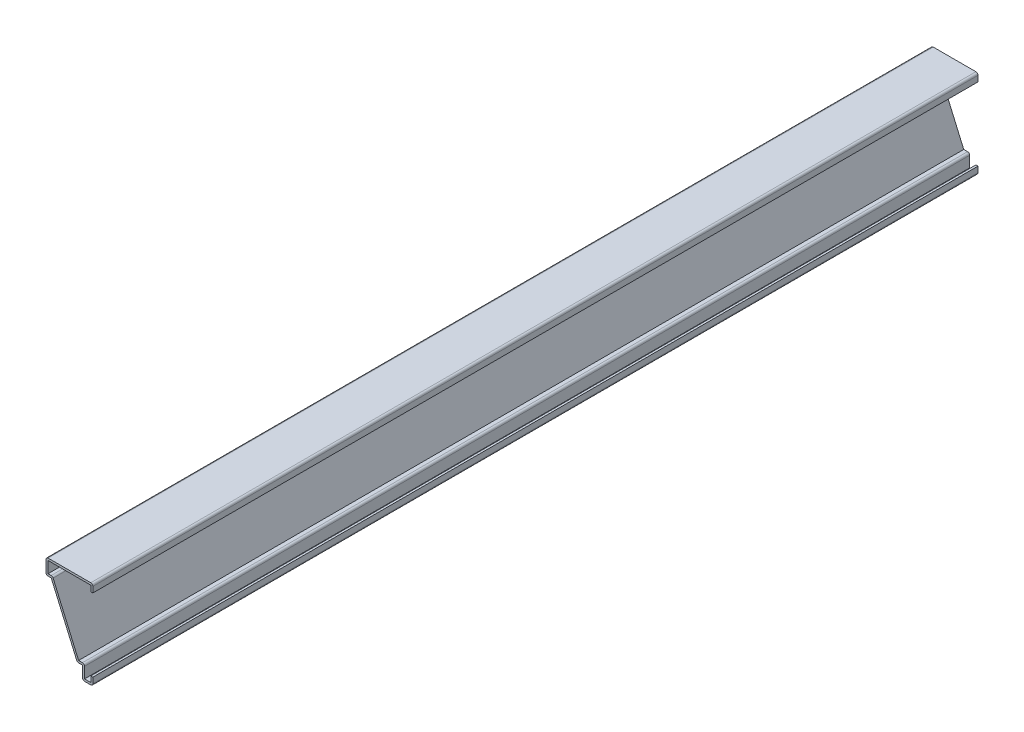
ISO-10303-21;
HEADER;
FILE_DESCRIPTION(('STEP AP214'),'2;1');
FILE_NAME('part.step','',(''),(''),'','','');
FILE_SCHEMA(('AUTOMOTIVE_DESIGN { 1 0 10303 214 1 1 1 1 }'));
ENDSEC;
DATA;
#1=APPLICATION_CONTEXT('core data for automotive mechanical design processes');
#2=APPLICATION_PROTOCOL_DEFINITION('international standard','automotive_design',2000,#1);
#3=PRODUCT_CONTEXT('',#1,'mechanical');
#4=PRODUCT('Part','Part','',(#3));
#5=PRODUCT_RELATED_PRODUCT_CATEGORY('part','',(#4));
#6=PRODUCT_DEFINITION_FORMATION('','',#4);
#7=PRODUCT_DEFINITION_CONTEXT('part definition',#1,'design');
#8=PRODUCT_DEFINITION('design','',#6,#7);
#9=PRODUCT_DEFINITION_SHAPE('','',#8);
#10=(LENGTH_UNIT() NAMED_UNIT(*) SI_UNIT(.MILLI.,.METRE.));
#11=(NAMED_UNIT(*) PLANE_ANGLE_UNIT() SI_UNIT($,.RADIAN.));
#12=(NAMED_UNIT(*) SI_UNIT($,.STERADIAN.) SOLID_ANGLE_UNIT());
#13=UNCERTAINTY_MEASURE_WITH_UNIT(LENGTH_MEASURE(1.E-05),#10,'distance_accuracy_value','');
#14=(GEOMETRIC_REPRESENTATION_CONTEXT(3) GLOBAL_UNCERTAINTY_ASSIGNED_CONTEXT((#13)) GLOBAL_UNIT_ASSIGNED_CONTEXT((#10,
#11,#12)) REPRESENTATION_CONTEXT('',''));
#15=CARTESIAN_POINT('',(0.,0.,0.));
#16=DIRECTION('',(0.,0.,1.));
#17=DIRECTION('',(1.,0.,0.));
#18=AXIS2_PLACEMENT_3D('',#15,#16,#17);
#19=CARTESIAN_POINT('',(0.,0.,-539.75));
#20=DIRECTION('',(1.,0.,0.));
#21=DIRECTION('',(0.,0.,-1.));
#22=AXIS2_PLACEMENT_3D('',#19,#20,#21);
#23=PLANE('',#22);
#24=DIRECTION('',(0.,1.,0.));
#25=VECTOR('',#24,1.);
#26=CARTESIAN_POINT('',(0.,0.,0.));
#27=LINE('',#26,#25);
#28=CARTESIAN_POINT('',(0.,1.27,0.));
#29=VERTEX_POINT('',#28);
#30=CARTESIAN_POINT('',(0.,4.7625,0.));
#31=VERTEX_POINT('',#30);
#32=EDGE_CURVE('E394',#29,#31,#27,.T.);
#33=ORIENTED_EDGE('',*,*,#32,.F.);
#34=DIRECTION('',(0.,0.,1.));
#35=VECTOR('',#34,1.);
#36=CARTESIAN_POINT('',(0.,1.27,-539.75));
#37=LINE('',#36,#35);
#38=CARTESIAN_POINT('',(0.,1.27,-539.75));
#39=VERTEX_POINT('',#38);
#40=EDGE_CURVE('E229',#29,#39,#37,.F.);
#41=ORIENTED_EDGE('',*,*,#40,.T.);
#42=DIRECTION('',(0.,1.,0.));
#43=VECTOR('',#42,1.);
#44=CARTESIAN_POINT('',(0.,0.,-539.75));
#45=LINE('',#44,#43);
#46=CARTESIAN_POINT('',(0.,4.7625,-539.75));
#47=VERTEX_POINT('',#46);
#48=EDGE_CURVE('E222',#39,#47,#45,.T.);
#49=ORIENTED_EDGE('',*,*,#48,.T.);
#50=DIRECTION('',(0.,0.,1.));
#51=VECTOR('',#50,1.);
#52=CARTESIAN_POINT('',(0.,4.7625,-539.75));
#53=LINE('',#52,#51);
#54=EDGE_CURVE('E226',#47,#31,#53,.T.);
#55=ORIENTED_EDGE('',*,*,#54,.T.);
#56=EDGE_LOOP('',(#33,#41,#49,#55));
#57=FACE_BOUND('',#56,.T.);
#58=ADVANCED_FACE('F35',(#57),#23,.T.);
#59=CARTESIAN_POINT('',(-6.35,0.,-539.75));
#60=DIRECTION('',(0.,-1.,0.));
#61=DIRECTION('',(0.,0.,-1.));
#62=AXIS2_PLACEMENT_3D('',#59,#60,#61);
#63=PLANE('',#62);
#64=DIRECTION('',(1.,0.,0.));
#65=VECTOR('',#64,1.);
#66=CARTESIAN_POINT('',(-6.35,0.,-539.75));
#67=LINE('',#66,#65);
#68=CARTESIAN_POINT('',(-5.08,0.,-539.75));
#69=VERTEX_POINT('',#68);
#70=CARTESIAN_POINT('',(-1.27,0.,-539.75));
#71=VERTEX_POINT('',#70);
#72=EDGE_CURVE('E246',#69,#71,#67,.T.);
#73=ORIENTED_EDGE('',*,*,#72,.T.);
#74=DIRECTION('',(0.,0.,1.));
#75=VECTOR('',#74,1.);
#76=CARTESIAN_POINT('',(-1.27,0.,-539.75));
#77=LINE('',#76,#75);
#78=CARTESIAN_POINT('',(-1.27,0.,0.));
#79=VERTEX_POINT('',#78);
#80=EDGE_CURVE('E257',#71,#79,#77,.T.);
#81=ORIENTED_EDGE('',*,*,#80,.T.);
#82=DIRECTION('',(1.,0.,0.));
#83=VECTOR('',#82,1.);
#84=CARTESIAN_POINT('',(-6.35,0.,0.));
#85=LINE('',#84,#83);
#86=CARTESIAN_POINT('',(-5.08,0.,0.));
#87=VERTEX_POINT('',#86);
#88=EDGE_CURVE('E232',#87,#79,#85,.T.);
#89=ORIENTED_EDGE('',*,*,#88,.F.);
#90=DIRECTION('',(0.,0.,1.));
#91=VECTOR('',#90,1.);
#92=CARTESIAN_POINT('',(-5.08,0.,-539.75));
#93=LINE('',#92,#91);
#94=EDGE_CURVE('E255',#87,#69,#93,.F.);
#95=ORIENTED_EDGE('',*,*,#94,.T.);
#96=EDGE_LOOP('',(#73,#81,#89,#95));
#97=FACE_BOUND('',#96,.T.);
#98=ADVANCED_FACE('F469',(#97),#63,.T.);
#99=CARTESIAN_POINT('',(-6.35,7.9375,-539.75));
#100=DIRECTION('',(-1.,0.,0.));
#101=DIRECTION('',(0.,0.,1.));
#102=AXIS2_PLACEMENT_3D('',#99,#100,#101);
#103=PLANE('',#102);
#104=DIRECTION('',(0.,-1.,0.));
#105=VECTOR('',#104,1.);
#106=CARTESIAN_POINT('',(-6.35,7.9375,-539.75));
#107=LINE('',#106,#105);
#108=CARTESIAN_POINT('',(-6.35,7.9375,-539.75));
#109=VERTEX_POINT('',#108);
#110=CARTESIAN_POINT('',(-6.35,1.27,-539.75));
#111=VERTEX_POINT('',#110);
#112=EDGE_CURVE('E251',#109,#111,#107,.T.);
#113=ORIENTED_EDGE('',*,*,#112,.T.);
#114=DIRECTION('',(0.,0.,1.));
#115=VECTOR('',#114,1.);
#116=CARTESIAN_POINT('',(-6.35,1.27,-539.75));
#117=LINE('',#116,#115);
#118=CARTESIAN_POINT('',(-6.35,1.27,0.));
#119=VERTEX_POINT('',#118);
#120=EDGE_CURVE('E293',#111,#119,#117,.T.);
#121=ORIENTED_EDGE('',*,*,#120,.T.);
#122=DIRECTION('',(0.,-1.,0.));
#123=VECTOR('',#122,1.);
#124=CARTESIAN_POINT('',(-6.35,7.9375,0.));
#125=LINE('',#124,#123);
#126=CARTESIAN_POINT('',(-6.35,7.9375,0.));
#127=VERTEX_POINT('',#126);
#128=EDGE_CURVE('E352',#127,#119,#125,.T.);
#129=ORIENTED_EDGE('',*,*,#128,.F.);
#130=DIRECTION('',(0.,0.,1.));
#131=VECTOR('',#130,1.);
#132=CARTESIAN_POINT('',(-6.35,7.9375,-539.75));
#133=LINE('',#132,#131);
#134=EDGE_CURVE('E258',#109,#127,#133,.T.);
#135=ORIENTED_EDGE('',*,*,#134,.F.);
#136=EDGE_LOOP('',(#113,#121,#129,#135));
#137=FACE_BOUND('',#136,.T.);
#138=ADVANCED_FACE('F479',(#137),#103,.T.);
#139=CARTESIAN_POINT('',(-9.52500000000001,7.9375,-539.75));
#140=DIRECTION('',(0.,-1.,0.));
#141=DIRECTION('',(0.,0.,-1.));
#142=AXIS2_PLACEMENT_3D('',#139,#140,#141);
#143=PLANE('',#142);
#144=DIRECTION('',(1.,0.,0.));
#145=VECTOR('',#144,1.);
#146=CARTESIAN_POINT('',(-9.52500000000001,7.9375,0.));
#147=LINE('',#146,#145);
#148=CARTESIAN_POINT('',(-8.69232878442955,7.9375,0.));
#149=VERTEX_POINT('',#148);
#150=EDGE_CURVE('E350',#149,#127,#147,.T.);
#151=ORIENTED_EDGE('',*,*,#150,.F.);
#152=DIRECTION('',(0.,0.,1.));
#153=VECTOR('',#152,1.);
#154=CARTESIAN_POINT('',(-8.69232878442955,7.9375,-539.75));
#155=LINE('',#154,#153);
#156=CARTESIAN_POINT('',(-8.69232878442955,7.9375,-539.75));
#157=VERTEX_POINT('',#156);
#158=EDGE_CURVE('E303',#149,#157,#155,.F.);
#159=ORIENTED_EDGE('',*,*,#158,.T.);
#160=DIRECTION('',(1.,0.,0.));
#161=VECTOR('',#160,1.);
#162=CARTESIAN_POINT('',(-9.52500000000001,7.9375,-539.75));
#163=LINE('',#162,#161);
#164=EDGE_CURVE('E460',#157,#109,#163,.T.);
#165=ORIENTED_EDGE('',*,*,#164,.T.);
#166=ORIENTED_EDGE('',*,*,#134,.T.);
#167=EDGE_LOOP('',(#151,#159,#165,#166));
#168=FACE_BOUND('',#167,.T.);
#169=ADVANCED_FACE('F483',(#168),#143,.T.);
#170=CARTESIAN_POINT('',(-25.4,44.45,-539.75));
#171=DIRECTION('',(-0.917070056253235,-0.39872611141445,0.));
#172=DIRECTION('',(0.39872611141445,-0.917070056253235,0.));
#173=AXIS2_PLACEMENT_3D('',#170,#171,#172);
#174=PLANE('',#173);
#175=DIRECTION('',(0.39872611141445,-0.917070056253235,0.));
#176=VECTOR('',#175,1.);
#177=CARTESIAN_POINT('',(-25.4,44.45,-539.75));
#178=LINE('',#177,#176);
#179=CARTESIAN_POINT('',(-25.4,44.45,-539.75));
#180=VERTEX_POINT('',#179);
#181=CARTESIAN_POINT('',(-9.85700775587117,8.70111783850366,-539.75));
#182=VERTEX_POINT('',#181);
#183=EDGE_CURVE('E457',#180,#182,#178,.T.);
#184=ORIENTED_EDGE('',*,*,#183,.T.);
#185=DIRECTION('',(0.,0.,1.));
#186=VECTOR('',#185,1.);
#187=CARTESIAN_POINT('',(-9.85700775587116,8.70111783850365,-539.75));
#188=LINE('',#187,#186);
#189=CARTESIAN_POINT('',(-9.85700775587117,8.70111783850366,0.));
#190=VERTEX_POINT('',#189);
#191=EDGE_CURVE('E300',#182,#190,#188,.T.);
#192=ORIENTED_EDGE('',*,*,#191,.T.);
#193=DIRECTION('',(0.39872611141445,-0.917070056253235,0.));
#194=VECTOR('',#193,1.);
#195=CARTESIAN_POINT('',(-25.4,44.45,0.));
#196=LINE('',#195,#194);
#197=CARTESIAN_POINT('',(-25.4,44.45,0.));
#198=VERTEX_POINT('',#197);
#199=EDGE_CURVE('E347',#198,#190,#196,.T.);
#200=ORIENTED_EDGE('',*,*,#199,.F.);
#201=DIRECTION('',(0.,0.,1.));
#202=VECTOR('',#201,1.);
#203=CARTESIAN_POINT('',(-25.4,44.45,-539.75));
#204=LINE('',#203,#202);
#205=EDGE_CURVE('E358',#180,#198,#204,.T.);
#206=ORIENTED_EDGE('',*,*,#205,.F.);
#207=EDGE_LOOP('',(#184,#192,#200,#206));
#208=FACE_BOUND('',#207,.T.);
#209=ADVANCED_FACE('F492',(#208),#174,.T.);
#210=CARTESIAN_POINT('',(-28.575,44.45,-539.75));
#211=DIRECTION('',(0.,-1.,0.));
#212=DIRECTION('',(0.,0.,-1.));
#213=AXIS2_PLACEMENT_3D('',#210,#211,#212);
#214=PLANE('',#213);
#215=DIRECTION('',(1.,0.,0.));
#216=VECTOR('',#215,1.);
#217=CARTESIAN_POINT('',(-28.575,44.45,0.));
#218=LINE('',#217,#216);
#219=CARTESIAN_POINT('',(-27.305,44.45,0.));
#220=VERTEX_POINT('',#219);
#221=EDGE_CURVE('E340',#220,#198,#218,.T.);
#222=ORIENTED_EDGE('',*,*,#221,.F.);
#223=DIRECTION('',(0.,0.,1.));
#224=VECTOR('',#223,1.);
#225=CARTESIAN_POINT('',(-27.305,44.45,-539.75));
#226=LINE('',#225,#224);
#227=CARTESIAN_POINT('',(-27.305,44.45,-539.75));
#228=VERTEX_POINT('',#227);
#229=EDGE_CURVE('E315',#220,#228,#226,.F.);
#230=ORIENTED_EDGE('',*,*,#229,.T.);
#231=DIRECTION('',(1.,0.,0.));
#232=VECTOR('',#231,1.);
#233=CARTESIAN_POINT('',(-28.575,44.45,-539.75));
#234=LINE('',#233,#232);
#235=EDGE_CURVE('E455',#228,#180,#234,.T.);
#236=ORIENTED_EDGE('',*,*,#235,.T.);
#237=ORIENTED_EDGE('',*,*,#205,.T.);
#238=EDGE_LOOP('',(#222,#230,#236,#237));
#239=FACE_BOUND('',#238,.T.);
#240=ADVANCED_FACE('F497',(#239),#214,.T.);
#241=CARTESIAN_POINT('',(-28.575,53.975,-539.75));
#242=DIRECTION('',(-1.,0.,0.));
#243=DIRECTION('',(0.,0.,1.));
#244=AXIS2_PLACEMENT_3D('',#241,#242,#243);
#245=PLANE('',#244);
#246=DIRECTION('',(0.,-1.,0.));
#247=VECTOR('',#246,1.);
#248=CARTESIAN_POINT('',(-28.575,53.975,-539.75));
#249=LINE('',#248,#247);
#250=CARTESIAN_POINT('',(-28.575,52.705,-539.75));
#251=VERTEX_POINT('',#250);
#252=CARTESIAN_POINT('',(-28.575,45.72,-539.75));
#253=VERTEX_POINT('',#252);
#254=EDGE_CURVE('E452',#251,#253,#249,.T.);
#255=ORIENTED_EDGE('',*,*,#254,.T.);
#256=DIRECTION('',(0.,0.,1.));
#257=VECTOR('',#256,1.);
#258=CARTESIAN_POINT('',(-28.575,45.72,-539.75));
#259=LINE('',#258,#257);
#260=CARTESIAN_POINT('',(-28.575,45.72,0.));
#261=VERTEX_POINT('',#260);
#262=EDGE_CURVE('E312',#253,#261,#259,.T.);
#263=ORIENTED_EDGE('',*,*,#262,.T.);
#264=DIRECTION('',(0.,-1.,0.));
#265=VECTOR('',#264,1.);
#266=CARTESIAN_POINT('',(-28.575,53.975,0.));
#267=LINE('',#266,#265);
#268=CARTESIAN_POINT('',(-28.575,52.705,0.));
#269=VERTEX_POINT('',#268);
#270=EDGE_CURVE('E337',#269,#261,#267,.T.);
#271=ORIENTED_EDGE('',*,*,#270,.F.);
#272=DIRECTION('',(0.,0.,1.));
#273=VECTOR('',#272,1.);
#274=CARTESIAN_POINT('',(-28.575,52.705,-539.75));
#275=LINE('',#274,#273);
#276=EDGE_CURVE('E310',#269,#251,#275,.F.);
#277=ORIENTED_EDGE('',*,*,#276,.T.);
#278=EDGE_LOOP('',(#255,#263,#271,#277));
#279=FACE_BOUND('',#278,.T.);
#280=ADVANCED_FACE('F505',(#279),#245,.T.);
#281=CARTESIAN_POINT('',(0.,53.975,-539.75));
#282=DIRECTION('',(0.,1.,0.));
#283=DIRECTION('',(-1.,0.,0.));
#284=AXIS2_PLACEMENT_3D('',#281,#282,#283);
#285=PLANE('',#284);
#286=DIRECTION('',(-1.,0.,0.));
#287=VECTOR('',#286,1.);
#288=CARTESIAN_POINT('',(0.,53.975,-539.75));
#289=LINE('',#288,#287);
#290=CARTESIAN_POINT('',(-1.27,53.975,-539.75));
#291=VERTEX_POINT('',#290);
#292=CARTESIAN_POINT('',(-27.305,53.975,-539.75));
#293=VERTEX_POINT('',#292);
#294=EDGE_CURVE('E328',#291,#293,#289,.T.);
#295=ORIENTED_EDGE('',*,*,#294,.T.);
#296=DIRECTION('',(0.,0.,1.));
#297=VECTOR('',#296,1.);
#298=CARTESIAN_POINT('',(-27.305,53.975,-539.75));
#299=LINE('',#298,#297);
#300=CARTESIAN_POINT('',(-27.305,53.975,0.));
#301=VERTEX_POINT('',#300);
#302=EDGE_CURVE('E43',#293,#301,#299,.T.);
#303=ORIENTED_EDGE('',*,*,#302,.T.);
#304=DIRECTION('',(-1.,0.,0.));
#305=VECTOR('',#304,1.);
#306=CARTESIAN_POINT('',(0.,53.975,0.));
#307=LINE('',#306,#305);
#308=CARTESIAN_POINT('',(-1.27,53.975,0.));
#309=VERTEX_POINT('',#308);
#310=EDGE_CURVE('E325',#309,#301,#307,.T.);
#311=ORIENTED_EDGE('',*,*,#310,.F.);
#312=DIRECTION('',(0.,0.,1.));
#313=VECTOR('',#312,1.);
#314=CARTESIAN_POINT('',(-1.27,53.975,-539.75));
#315=LINE('',#314,#313);
#316=EDGE_CURVE('E317',#309,#291,#315,.F.);
#317=ORIENTED_EDGE('',*,*,#316,.T.);
#318=EDGE_LOOP('',(#295,#303,#311,#317));
#319=FACE_BOUND('',#318,.T.);
#320=ADVANCED_FACE('F324',(#319),#285,.T.);
#321=CARTESIAN_POINT('',(0.,49.2125,-539.75));
#322=DIRECTION('',(1.,0.,0.));
#323=DIRECTION('',(0.,1.,0.));
#324=AXIS2_PLACEMENT_3D('',#321,#322,#323);
#325=PLANE('',#324);
#326=DIRECTION('',(0.,1.,0.));
#327=VECTOR('',#326,1.);
#328=CARTESIAN_POINT('',(0.,49.2125,-539.75));
#329=LINE('',#328,#327);
#330=CARTESIAN_POINT('',(0.,49.2125,-539.75));
#331=VERTEX_POINT('',#330);
#332=CARTESIAN_POINT('',(0.,52.705,-539.75));
#333=VERTEX_POINT('',#332);
#334=EDGE_CURVE('E448',#331,#333,#329,.T.);
#335=ORIENTED_EDGE('',*,*,#334,.T.);
#336=DIRECTION('',(0.,0.,1.));
#337=VECTOR('',#336,1.);
#338=CARTESIAN_POINT('',(0.,52.705,-539.75));
#339=LINE('',#338,#337);
#340=CARTESIAN_POINT('',(0.,52.705,0.));
#341=VERTEX_POINT('',#340);
#342=EDGE_CURVE('E11',#333,#341,#339,.T.);
#343=ORIENTED_EDGE('',*,*,#342,.T.);
#344=DIRECTION('',(0.,1.,0.));
#345=VECTOR('',#344,1.);
#346=CARTESIAN_POINT('',(0.,49.2125,0.));
#347=LINE('',#346,#345);
#348=CARTESIAN_POINT('',(0.,49.2125,0.));
#349=VERTEX_POINT('',#348);
#350=EDGE_CURVE('E338',#349,#341,#347,.T.);
#351=ORIENTED_EDGE('',*,*,#350,.F.);
#352=DIRECTION('',(0.,0.,1.));
#353=VECTOR('',#352,1.);
#354=CARTESIAN_POINT('',(0.,49.2125,-539.75));
#355=LINE('',#354,#353);
#356=EDGE_CURVE('E361',#331,#349,#355,.T.);
#357=ORIENTED_EDGE('',*,*,#356,.F.);
#358=EDGE_LOOP('',(#335,#343,#351,#357));
#359=FACE_BOUND('',#358,.T.);
#360=ADVANCED_FACE('F598',(#359),#325,.T.);
#361=CARTESIAN_POINT('',(0.,49.2125,-539.75));
#362=DIRECTION('',(0.,1.,0.));
#363=DIRECTION('',(0.,0.,1.));
#364=AXIS2_PLACEMENT_3D('',#361,#362,#363);
#365=PLANE('',#364);
#366=DIRECTION('',(-1.,0.,0.));
#367=VECTOR('',#366,1.);
#368=CARTESIAN_POINT('',(0.,49.2125,0.));
#369=LINE('',#368,#367);
#370=CARTESIAN_POINT('',(-1.27,49.2125,0.));
#371=VERTEX_POINT('',#370);
#372=EDGE_CURVE('E342',#349,#371,#369,.T.);
#373=ORIENTED_EDGE('',*,*,#372,.T.);
#374=DIRECTION('',(0.,0.,1.));
#375=VECTOR('',#374,1.);
#376=CARTESIAN_POINT('',(-1.27,49.2125,-539.75));
#377=LINE('',#376,#375);
#378=CARTESIAN_POINT('',(-1.27,49.2125,-539.75));
#379=VERTEX_POINT('',#378);
#380=EDGE_CURVE('E363',#379,#371,#377,.T.);
#381=ORIENTED_EDGE('',*,*,#380,.F.);
#382=DIRECTION('',(-1.,0.,0.));
#383=VECTOR('',#382,1.);
#384=CARTESIAN_POINT('',(0.,49.2125,-539.75));
#385=LINE('',#384,#383);
#386=EDGE_CURVE('E446',#331,#379,#385,.T.);
#387=ORIENTED_EDGE('',*,*,#386,.F.);
#388=ORIENTED_EDGE('',*,*,#356,.T.);
#389=EDGE_LOOP('',(#373,#381,#387,#388));
#390=FACE_BOUND('',#389,.T.);
#391=ADVANCED_FACE('F414',(#390),#365,.F.);
#392=CARTESIAN_POINT('',(-1.27,49.2125,-539.75));
#393=DIRECTION('',(1.,0.,0.));
#394=DIRECTION('',(0.,1.,0.));
#395=AXIS2_PLACEMENT_3D('',#392,#393,#394);
#396=PLANE('',#395);
#397=DIRECTION('',(0.,1.,0.));
#398=VECTOR('',#397,1.);
#399=CARTESIAN_POINT('',(-1.27,49.2125,0.));
#400=LINE('',#399,#398);
#401=CARTESIAN_POINT('',(-1.27,52.705,0.));
#402=VERTEX_POINT('',#401);
#403=EDGE_CURVE('E410',#371,#402,#400,.T.);
#404=ORIENTED_EDGE('',*,*,#403,.T.);
#405=DIRECTION('',(0.,0.,1.));
#406=VECTOR('',#405,1.);
#407=CARTESIAN_POINT('',(-1.27,52.705,-539.75));
#408=LINE('',#407,#406);
#409=CARTESIAN_POINT('',(-1.27,52.705,-539.75));
#410=VERTEX_POINT('',#409);
#411=EDGE_CURVE('E366',#410,#402,#408,.T.);
#412=ORIENTED_EDGE('',*,*,#411,.F.);
#413=DIRECTION('',(0.,1.,0.));
#414=VECTOR('',#413,1.);
#415=CARTESIAN_POINT('',(-1.27,49.2125,-539.75));
#416=LINE('',#415,#414);
#417=EDGE_CURVE('E422',#379,#410,#416,.T.);
#418=ORIENTED_EDGE('',*,*,#417,.F.);
#419=ORIENTED_EDGE('',*,*,#380,.T.);
#420=EDGE_LOOP('',(#404,#412,#418,#419));
#421=FACE_BOUND('',#420,.T.);
#422=ADVANCED_FACE('F420',(#421),#396,.F.);
#423=CARTESIAN_POINT('',(0.,52.705,-539.75));
#424=DIRECTION('',(0.,1.,0.));
#425=DIRECTION('',(-1.,0.,0.));
#426=AXIS2_PLACEMENT_3D('',#423,#424,#425);
#427=PLANE('',#426);
#428=DIRECTION('',(-1.,0.,0.));
#429=VECTOR('',#428,1.);
#430=CARTESIAN_POINT('',(0.,52.705,0.));
#431=LINE('',#430,#429);
#432=CARTESIAN_POINT('',(-27.305,52.705,0.));
#433=VERTEX_POINT('',#432);
#434=EDGE_CURVE('E408',#402,#433,#431,.T.);
#435=ORIENTED_EDGE('',*,*,#434,.T.);
#436=DIRECTION('',(0.,0.,1.));
#437=VECTOR('',#436,1.);
#438=CARTESIAN_POINT('',(-27.305,52.705,-539.75));
#439=LINE('',#438,#437);
#440=CARTESIAN_POINT('',(-27.305,52.705,-539.75));
#441=VERTEX_POINT('',#440);
#442=EDGE_CURVE('E369',#441,#433,#439,.T.);
#443=ORIENTED_EDGE('',*,*,#442,.F.);
#444=DIRECTION('',(-1.,0.,0.));
#445=VECTOR('',#444,1.);
#446=CARTESIAN_POINT('',(0.,52.705,-539.75));
#447=LINE('',#446,#445);
#448=EDGE_CURVE('E437',#410,#441,#447,.T.);
#449=ORIENTED_EDGE('',*,*,#448,.F.);
#450=ORIENTED_EDGE('',*,*,#411,.T.);
#451=EDGE_LOOP('',(#435,#443,#449,#450));
#452=FACE_BOUND('',#451,.T.);
#453=ADVANCED_FACE('F428',(#452),#427,.F.);
#454=CARTESIAN_POINT('',(-27.305,53.975,-539.75));
#455=DIRECTION('',(-1.,0.,0.));
#456=DIRECTION('',(0.,0.,1.));
#457=AXIS2_PLACEMENT_3D('',#454,#455,#456);
#458=PLANE('',#457);
#459=DIRECTION('',(0.,1.,0.));
#460=VECTOR('',#459,1.);
#461=CARTESIAN_POINT('',(-27.305,53.975,0.));
#462=LINE('',#461,#460);
#463=CARTESIAN_POINT('',(-27.305,45.72,0.));
#464=VERTEX_POINT('',#463);
#465=EDGE_CURVE('E406',#433,#464,#462,.F.);
#466=ORIENTED_EDGE('',*,*,#465,.T.);
#467=DIRECTION('',(0.,0.,1.));
#468=VECTOR('',#467,1.);
#469=CARTESIAN_POINT('',(-27.305,45.72,-539.75));
#470=LINE('',#469,#468);
#471=CARTESIAN_POINT('',(-27.305,45.72,-539.75));
#472=VERTEX_POINT('',#471);
#473=EDGE_CURVE('E372',#472,#464,#470,.T.);
#474=ORIENTED_EDGE('',*,*,#473,.F.);
#475=DIRECTION('',(0.,1.,0.));
#476=VECTOR('',#475,1.);
#477=CARTESIAN_POINT('',(-27.305,53.975,-539.75));
#478=LINE('',#477,#476);
#479=EDGE_CURVE('E434',#441,#472,#478,.F.);
#480=ORIENTED_EDGE('',*,*,#479,.F.);
#481=ORIENTED_EDGE('',*,*,#442,.T.);
#482=EDGE_LOOP('',(#466,#474,#480,#481));
#483=FACE_BOUND('',#482,.T.);
#484=ADVANCED_FACE('F432',(#483),#458,.F.);
#485=CARTESIAN_POINT('',(-28.575,45.72,-539.75));
#486=DIRECTION('',(0.,-1.,0.));
#487=DIRECTION('',(0.,0.,-1.));
#488=AXIS2_PLACEMENT_3D('',#485,#486,#487);
#489=PLANE('',#488);
#490=DIRECTION('',(1.,0.,0.));
#491=VECTOR('',#490,1.);
#492=CARTESIAN_POINT('',(-28.575,45.72,0.));
#493=LINE('',#492,#491);
#494=CARTESIAN_POINT('',(-25.4,45.72,0.));
#495=VERTEX_POINT('',#494);
#496=EDGE_CURVE('E403',#464,#495,#493,.T.);
#497=ORIENTED_EDGE('',*,*,#496,.T.);
#498=DIRECTION('',(0.,0.,1.));
#499=VECTOR('',#498,1.);
#500=CARTESIAN_POINT('',(-25.4,45.72,-539.75));
#501=LINE('',#500,#499);
#502=CARTESIAN_POINT('',(-25.4,45.72,-539.75));
#503=VERTEX_POINT('',#502);
#504=EDGE_CURVE('E308',#495,#503,#501,.F.);
#505=ORIENTED_EDGE('',*,*,#504,.T.);
#506=DIRECTION('',(1.,0.,0.));
#507=VECTOR('',#506,1.);
#508=CARTESIAN_POINT('',(-28.575,45.72,-539.75));
#509=LINE('',#508,#507);
#510=EDGE_CURVE('E438',#472,#503,#509,.T.);
#511=ORIENTED_EDGE('',*,*,#510,.F.);
#512=ORIENTED_EDGE('',*,*,#473,.T.);
#513=EDGE_LOOP('',(#497,#505,#511,#512));
#514=FACE_BOUND('',#513,.T.);
#515=ADVANCED_FACE('F568',(#514),#489,.F.);
#516=CARTESIAN_POINT('',(-24.2353210285584,44.9563821614964,-539.75));
#517=DIRECTION('',(-0.917070056253235,-0.39872611141445,0.));
#518=DIRECTION('',(0.39872611141445,-0.917070056253235,0.));
#519=AXIS2_PLACEMENT_3D('',#516,#517,#518);
#520=PLANE('',#519);
#521=DIRECTION('',(0.39872611141445,-0.917070056253235,0.));
#522=VECTOR('',#521,1.);
#523=CARTESIAN_POINT('',(-24.2353210285584,44.9563821614964,-539.75));
#524=LINE('',#523,#522);
#525=CARTESIAN_POINT('',(-24.2353210285584,44.9563821614964,-539.75));
#526=VERTEX_POINT('',#525);
#527=CARTESIAN_POINT('',(-8.69232878442955,9.2075,-539.75));
#528=VERTEX_POINT('',#527);
#529=EDGE_CURVE('E441',#526,#528,#524,.T.);
#530=ORIENTED_EDGE('',*,*,#529,.F.);
#531=DIRECTION('',(0.,0.,1.));
#532=VECTOR('',#531,1.);
#533=CARTESIAN_POINT('',(-24.2353210285584,44.9563821614964,-539.75));
#534=LINE('',#533,#532);
#535=CARTESIAN_POINT('',(-24.2353210285584,44.9563821614964,0.));
#536=VERTEX_POINT('',#535);
#537=EDGE_CURVE('E305',#526,#536,#534,.T.);
#538=ORIENTED_EDGE('',*,*,#537,.T.);
#539=DIRECTION('',(0.39872611141445,-0.917070056253235,0.));
#540=VECTOR('',#539,1.);
#541=CARTESIAN_POINT('',(-24.2353210285584,44.9563821614964,0.));
#542=LINE('',#541,#540);
#543=CARTESIAN_POINT('',(-8.69232878442955,9.2075,0.));
#544=VERTEX_POINT('',#543);
#545=EDGE_CURVE('E401',#536,#544,#542,.T.);
#546=ORIENTED_EDGE('',*,*,#545,.T.);
#547=DIRECTION('',(0.,0.,1.));
#548=VECTOR('',#547,1.);
#549=CARTESIAN_POINT('',(-8.69232878442955,9.2075,-539.75));
#550=LINE('',#549,#548);
#551=EDGE_CURVE('E375',#528,#544,#550,.T.);
#552=ORIENTED_EDGE('',*,*,#551,.F.);
#553=EDGE_LOOP('',(#530,#538,#546,#552));
#554=FACE_BOUND('',#553,.T.);
#555=ADVANCED_FACE('F545',(#554),#520,.F.);
#556=CARTESIAN_POINT('',(-9.52500000000001,9.2075,-539.75));
#557=DIRECTION('',(0.,-1.,0.));
#558=DIRECTION('',(0.,0.,-1.));
#559=AXIS2_PLACEMENT_3D('',#556,#557,#558);
#560=PLANE('',#559);
#561=DIRECTION('',(1.,0.,0.));
#562=VECTOR('',#561,1.);
#563=CARTESIAN_POINT('',(-9.52500000000001,9.2075,0.));
#564=LINE('',#563,#562);
#565=CARTESIAN_POINT('',(-6.35,9.2075,0.));
#566=VERTEX_POINT('',#565);
#567=EDGE_CURVE('E399',#544,#566,#564,.T.);
#568=ORIENTED_EDGE('',*,*,#567,.T.);
#569=DIRECTION('',(0.,0.,1.));
#570=VECTOR('',#569,1.);
#571=CARTESIAN_POINT('',(-6.35,9.2075,-539.75));
#572=LINE('',#571,#570);
#573=CARTESIAN_POINT('',(-6.35,9.2075,-539.75));
#574=VERTEX_POINT('',#573);
#575=EDGE_CURVE('E58',#566,#574,#572,.F.);
#576=ORIENTED_EDGE('',*,*,#575,.T.);
#577=DIRECTION('',(1.,0.,0.));
#578=VECTOR('',#577,1.);
#579=CARTESIAN_POINT('',(-9.52500000000001,9.2075,-539.75));
#580=LINE('',#579,#578);
#581=EDGE_CURVE('E547',#528,#574,#580,.T.);
#582=ORIENTED_EDGE('',*,*,#581,.F.);
#583=ORIENTED_EDGE('',*,*,#551,.T.);
#584=EDGE_LOOP('',(#568,#576,#582,#583));
#585=FACE_BOUND('',#584,.T.);
#586=ADVANCED_FACE('F560',(#585),#560,.F.);
#587=CARTESIAN_POINT('',(-5.08,7.9375,-539.75));
#588=DIRECTION('',(-1.,0.,0.));
#589=DIRECTION('',(0.,0.,1.));
#590=AXIS2_PLACEMENT_3D('',#587,#588,#589);
#591=PLANE('',#590);
#592=DIRECTION('',(0.,1.,0.));
#593=VECTOR('',#592,1.);
#594=CARTESIAN_POINT('',(-5.08,7.9375,-539.75));
#595=LINE('',#594,#593);
#596=CARTESIAN_POINT('',(-5.08,7.9375,-539.75));
#597=VERTEX_POINT('',#596);
#598=CARTESIAN_POINT('',(-5.08,1.27,-539.75));
#599=VERTEX_POINT('',#598);
#600=EDGE_CURVE('E548',#597,#599,#595,.F.);
#601=ORIENTED_EDGE('',*,*,#600,.F.);
#602=DIRECTION('',(0.,0.,1.));
#603=VECTOR('',#602,1.);
#604=CARTESIAN_POINT('',(-5.08,7.9375,-539.75));
#605=LINE('',#604,#603);
#606=CARTESIAN_POINT('',(-5.08,7.9375,0.));
#607=VERTEX_POINT('',#606);
#608=EDGE_CURVE('E296',#597,#607,#605,.T.);
#609=ORIENTED_EDGE('',*,*,#608,.T.);
#610=DIRECTION('',(0.,1.,0.));
#611=VECTOR('',#610,1.);
#612=CARTESIAN_POINT('',(-5.08,7.9375,0.));
#613=LINE('',#612,#611);
#614=CARTESIAN_POINT('',(-5.08,1.27,0.));
#615=VERTEX_POINT('',#614);
#616=EDGE_CURVE('E392',#607,#615,#613,.F.);
#617=ORIENTED_EDGE('',*,*,#616,.T.);
#618=DIRECTION('',(0.,0.,1.));
#619=VECTOR('',#618,1.);
#620=CARTESIAN_POINT('',(-5.08,1.27,-539.75));
#621=LINE('',#620,#619);
#622=EDGE_CURVE('E378',#599,#615,#621,.T.);
#623=ORIENTED_EDGE('',*,*,#622,.F.);
#624=EDGE_LOOP('',(#601,#609,#617,#623));
#625=FACE_BOUND('',#624,.T.);
#626=ADVANCED_FACE('F557',(#625),#591,.F.);
#627=CARTESIAN_POINT('',(-6.35,1.27,-539.75));
#628=DIRECTION('',(0.,-1.,0.));
#629=DIRECTION('',(0.,0.,-1.));
#630=AXIS2_PLACEMENT_3D('',#627,#628,#629);
#631=PLANE('',#630);
#632=DIRECTION('',(1.,0.,0.));
#633=VECTOR('',#632,1.);
#634=CARTESIAN_POINT('',(-6.35,1.27,0.));
#635=LINE('',#634,#633);
#636=CARTESIAN_POINT('',(-1.27,1.27,0.));
#637=VERTEX_POINT('',#636);
#638=EDGE_CURVE('E390',#615,#637,#635,.T.);
#639=ORIENTED_EDGE('',*,*,#638,.T.);
#640=DIRECTION('',(0.,0.,1.));
#641=VECTOR('',#640,1.);
#642=CARTESIAN_POINT('',(-1.27,1.27,-539.75));
#643=LINE('',#642,#641);
#644=CARTESIAN_POINT('',(-1.27,1.27,-539.75));
#645=VERTEX_POINT('',#644);
#646=EDGE_CURVE('E248',#645,#637,#643,.T.);
#647=ORIENTED_EDGE('',*,*,#646,.F.);
#648=DIRECTION('',(1.,0.,0.));
#649=VECTOR('',#648,1.);
#650=CARTESIAN_POINT('',(-6.35,1.27,-539.75));
#651=LINE('',#650,#649);
#652=EDGE_CURVE('E552',#599,#645,#651,.T.);
#653=ORIENTED_EDGE('',*,*,#652,.F.);
#654=ORIENTED_EDGE('',*,*,#622,.T.);
#655=EDGE_LOOP('',(#639,#647,#653,#654));
#656=FACE_BOUND('',#655,.T.);
#657=ADVANCED_FACE('F555',(#656),#631,.F.);
#658=CARTESIAN_POINT('',(-1.27,0.,-539.75));
#659=DIRECTION('',(1.,0.,0.));
#660=DIRECTION('',(0.,0.,-1.));
#661=AXIS2_PLACEMENT_3D('',#658,#659,#660);
#662=PLANE('',#661);
#663=DIRECTION('',(0.,1.,0.));
#664=VECTOR('',#663,1.);
#665=CARTESIAN_POINT('',(-1.27,0.,0.));
#666=LINE('',#665,#664);
#667=CARTESIAN_POINT('',(-1.27,4.7625,0.));
#668=VERTEX_POINT('',#667);
#669=EDGE_CURVE('E385',#637,#668,#666,.T.);
#670=ORIENTED_EDGE('',*,*,#669,.T.);
#671=DIRECTION('',(0.,0.,1.));
#672=VECTOR('',#671,1.);
#673=CARTESIAN_POINT('',(-1.27,4.7625,-539.75));
#674=LINE('',#673,#672);
#675=CARTESIAN_POINT('',(-1.27,4.7625,-539.75));
#676=VERTEX_POINT('',#675);
#677=EDGE_CURVE('E245',#676,#668,#674,.T.);
#678=ORIENTED_EDGE('',*,*,#677,.F.);
#679=DIRECTION('',(0.,1.,0.));
#680=VECTOR('',#679,1.);
#681=CARTESIAN_POINT('',(-1.27,0.,-539.75));
#682=LINE('',#681,#680);
#683=EDGE_CURVE('E237',#645,#676,#682,.T.);
#684=ORIENTED_EDGE('',*,*,#683,.F.);
#685=ORIENTED_EDGE('',*,*,#646,.T.);
#686=EDGE_LOOP('',(#670,#678,#684,#685));
#687=FACE_BOUND('',#686,.T.);
#688=ADVANCED_FACE('F384',(#687),#662,.F.);
#689=CARTESIAN_POINT('',(-1.27,4.7625,-539.75));
#690=DIRECTION('',(0.,-1.,0.));
#691=DIRECTION('',(0.,0.,-1.));
#692=AXIS2_PLACEMENT_3D('',#689,#690,#691);
#693=PLANE('',#692);
#694=DIRECTION('',(1.,0.,0.));
#695=VECTOR('',#694,1.);
#696=CARTESIAN_POINT('',(-1.27,4.7625,0.));
#697=LINE('',#696,#695);
#698=EDGE_CURVE('E244',#668,#31,#697,.T.);
#699=ORIENTED_EDGE('',*,*,#698,.T.);
#700=ORIENTED_EDGE('',*,*,#54,.F.);
#701=DIRECTION('',(1.,0.,0.));
#702=VECTOR('',#701,1.);
#703=CARTESIAN_POINT('',(-1.27,4.7625,-539.75));
#704=LINE('',#703,#702);
#705=EDGE_CURVE('E231',#676,#47,#704,.T.);
#706=ORIENTED_EDGE('',*,*,#705,.F.);
#707=ORIENTED_EDGE('',*,*,#677,.T.);
#708=EDGE_LOOP('',(#699,#700,#706,#707));
#709=FACE_BOUND('',#708,.T.);
#710=ADVANCED_FACE('F242',(#709),#693,.F.);
#711=CARTESIAN_POINT('',(0.,0.,-539.75));
#712=DIRECTION('',(0.,0.,-1.));
#713=DIRECTION('',(-1.,0.,0.));
#714=AXIS2_PLACEMENT_3D('',#711,#712,#713);
#715=PLANE('',#714);
#716=ORIENTED_EDGE('',*,*,#48,.F.);
#717=CARTESIAN_POINT('',(-1.27,1.27,-539.75));
#718=DIRECTION('',(0.,0.,-1.));
#719=DIRECTION('',(-1.,0.,0.));
#720=AXIS2_PLACEMENT_3D('',#717,#718,#719);
#721=CIRCLE('',#720,1.27);
#722=EDGE_CURVE('E291',#39,#71,#721,.T.);
#723=ORIENTED_EDGE('',*,*,#722,.T.);
#724=ORIENTED_EDGE('',*,*,#72,.F.);
#725=CARTESIAN_POINT('',(-5.08,1.27,-539.75));
#726=DIRECTION('',(0.,0.,-1.));
#727=DIRECTION('',(-1.,0.,0.));
#728=AXIS2_PLACEMENT_3D('',#725,#726,#727);
#729=CIRCLE('',#728,1.27);
#730=EDGE_CURVE('E289',#69,#111,#729,.T.);
#731=ORIENTED_EDGE('',*,*,#730,.T.);
#732=ORIENTED_EDGE('',*,*,#112,.F.);
#733=ORIENTED_EDGE('',*,*,#164,.F.);
#734=CARTESIAN_POINT('',(-8.69232878442955,9.2075,-539.75));
#735=DIRECTION('',(0.,0.,-1.));
#736=DIRECTION('',(-1.,0.,0.));
#737=AXIS2_PLACEMENT_3D('',#734,#735,#736);
#738=CIRCLE('',#737,1.27);
#739=EDGE_CURVE('E286',#157,#182,#738,.T.);
#740=ORIENTED_EDGE('',*,*,#739,.T.);
#741=ORIENTED_EDGE('',*,*,#183,.F.);
#742=ORIENTED_EDGE('',*,*,#235,.F.);
#743=CARTESIAN_POINT('',(-27.305,45.72,-539.75));
#744=DIRECTION('',(0.,0.,-1.));
#745=DIRECTION('',(-1.,0.,0.));
#746=AXIS2_PLACEMENT_3D('',#743,#744,#745);
#747=CIRCLE('',#746,1.27);
#748=EDGE_CURVE('E282',#228,#253,#747,.T.);
#749=ORIENTED_EDGE('',*,*,#748,.T.);
#750=ORIENTED_EDGE('',*,*,#254,.F.);
#751=CARTESIAN_POINT('',(-27.305,52.705,-539.75));
#752=DIRECTION('',(0.,0.,-1.));
#753=DIRECTION('',(-1.,0.,0.));
#754=AXIS2_PLACEMENT_3D('',#751,#752,#753);
#755=CIRCLE('',#754,1.27);
#756=EDGE_CURVE('E280',#251,#293,#755,.T.);
#757=ORIENTED_EDGE('',*,*,#756,.T.);
#758=ORIENTED_EDGE('',*,*,#294,.F.);
#759=CARTESIAN_POINT('',(-1.27,52.705,-539.75));
#760=DIRECTION('',(0.,0.,-1.));
#761=DIRECTION('',(-1.,0.,0.));
#762=AXIS2_PLACEMENT_3D('',#759,#760,#761);
#763=CIRCLE('',#762,1.27);
#764=EDGE_CURVE('E278',#291,#333,#763,.T.);
#765=ORIENTED_EDGE('',*,*,#764,.T.);
#766=ORIENTED_EDGE('',*,*,#334,.F.);
#767=ORIENTED_EDGE('',*,*,#386,.T.);
#768=ORIENTED_EDGE('',*,*,#417,.T.);
#769=ORIENTED_EDGE('',*,*,#448,.T.);
#770=ORIENTED_EDGE('',*,*,#479,.T.);
#771=ORIENTED_EDGE('',*,*,#510,.T.);
#772=CARTESIAN_POINT('',(-25.4,44.45,-539.75));
#773=DIRECTION('',(0.,0.,-1.));
#774=DIRECTION('',(-1.,0.,0.));
#775=AXIS2_PLACEMENT_3D('',#772,#773,#774);
#776=CIRCLE('',#775,1.27);
#777=EDGE_CURVE('E284',#503,#526,#776,.T.);
#778=ORIENTED_EDGE('',*,*,#777,.T.);
#779=ORIENTED_EDGE('',*,*,#529,.T.);
#780=ORIENTED_EDGE('',*,*,#581,.T.);
#781=CARTESIAN_POINT('',(-6.35,7.9375,-539.75));
#782=DIRECTION('',(0.,0.,-1.));
#783=DIRECTION('',(-1.,0.,0.));
#784=AXIS2_PLACEMENT_3D('',#781,#782,#783);
#785=CIRCLE('',#784,1.27);
#786=EDGE_CURVE('E50',#574,#597,#785,.T.);
#787=ORIENTED_EDGE('',*,*,#786,.T.);
#788=ORIENTED_EDGE('',*,*,#600,.T.);
#789=ORIENTED_EDGE('',*,*,#652,.T.);
#790=ORIENTED_EDGE('',*,*,#683,.T.);
#791=ORIENTED_EDGE('',*,*,#705,.T.);
#792=EDGE_LOOP('',(#716,#723,#724,#731,#732,#733,#740,#741,#742,#749,#750,#757,#758,#765,#766,
#767,#768,#769,#770,#771,#778,#779,#780,#787,#788,#789,#790,#791));
#793=FACE_BOUND('',#792,.T.);
#794=ADVANCED_FACE('F235',(#793),#715,.T.);
#795=CARTESIAN_POINT('',(0.,0.,0.));
#796=DIRECTION('',(0.,0.,-1.));
#797=DIRECTION('',(-1.,0.,0.));
#798=AXIS2_PLACEMENT_3D('',#795,#796,#797);
#799=PLANE('',#798);
#800=ORIENTED_EDGE('',*,*,#88,.T.);
#801=CARTESIAN_POINT('',(-1.27,1.27,0.));
#802=DIRECTION('',(0.,0.,-1.));
#803=DIRECTION('',(-1.,0.,0.));
#804=AXIS2_PLACEMENT_3D('',#801,#802,#803);
#805=CIRCLE('',#804,1.27);
#806=EDGE_CURVE('E275',#79,#29,#805,.F.);
#807=ORIENTED_EDGE('',*,*,#806,.T.);
#808=ORIENTED_EDGE('',*,*,#32,.T.);
#809=ORIENTED_EDGE('',*,*,#698,.F.);
#810=ORIENTED_EDGE('',*,*,#669,.F.);
#811=ORIENTED_EDGE('',*,*,#638,.F.);
#812=ORIENTED_EDGE('',*,*,#616,.F.);
#813=CARTESIAN_POINT('',(-6.35,7.9375,0.));
#814=DIRECTION('',(0.,0.,-1.));
#815=DIRECTION('',(-1.,0.,0.));
#816=AXIS2_PLACEMENT_3D('',#813,#814,#815);
#817=CIRCLE('',#816,1.27);
#818=EDGE_CURVE('E271',#607,#566,#817,.F.);
#819=ORIENTED_EDGE('',*,*,#818,.T.);
#820=ORIENTED_EDGE('',*,*,#567,.F.);
#821=ORIENTED_EDGE('',*,*,#545,.F.);
#822=CARTESIAN_POINT('',(-25.4,44.45,0.));
#823=DIRECTION('',(0.,0.,-1.));
#824=DIRECTION('',(-1.,0.,0.));
#825=AXIS2_PLACEMENT_3D('',#822,#823,#824);
#826=CIRCLE('',#825,1.27);
#827=EDGE_CURVE('E267',#536,#495,#826,.F.);
#828=ORIENTED_EDGE('',*,*,#827,.T.);
#829=ORIENTED_EDGE('',*,*,#496,.F.);
#830=ORIENTED_EDGE('',*,*,#465,.F.);
#831=ORIENTED_EDGE('',*,*,#434,.F.);
#832=ORIENTED_EDGE('',*,*,#403,.F.);
#833=ORIENTED_EDGE('',*,*,#372,.F.);
#834=ORIENTED_EDGE('',*,*,#350,.T.);
#835=CARTESIAN_POINT('',(-1.27,52.705,0.));
#836=DIRECTION('',(0.,0.,-1.));
#837=DIRECTION('',(-1.,0.,0.));
#838=AXIS2_PLACEMENT_3D('',#835,#836,#837);
#839=CIRCLE('',#838,1.27);
#840=EDGE_CURVE('E261',#341,#309,#839,.F.);
#841=ORIENTED_EDGE('',*,*,#840,.T.);
#842=ORIENTED_EDGE('',*,*,#310,.T.);
#843=CARTESIAN_POINT('',(-27.305,52.705,0.));
#844=DIRECTION('',(0.,0.,-1.));
#845=DIRECTION('',(-1.,0.,0.));
#846=AXIS2_PLACEMENT_3D('',#843,#844,#845);
#847=CIRCLE('',#846,1.27);
#848=EDGE_CURVE('E263',#301,#269,#847,.F.);
#849=ORIENTED_EDGE('',*,*,#848,.T.);
#850=ORIENTED_EDGE('',*,*,#270,.T.);
#851=CARTESIAN_POINT('',(-27.305,45.72,0.));
#852=DIRECTION('',(0.,0.,-1.));
#853=DIRECTION('',(-1.,0.,0.));
#854=AXIS2_PLACEMENT_3D('',#851,#852,#853);
#855=CIRCLE('',#854,1.27);
#856=EDGE_CURVE('E265',#261,#220,#855,.F.);
#857=ORIENTED_EDGE('',*,*,#856,.T.);
#858=ORIENTED_EDGE('',*,*,#221,.T.);
#859=ORIENTED_EDGE('',*,*,#199,.T.);
#860=CARTESIAN_POINT('',(-8.69232878442955,9.2075,0.));
#861=DIRECTION('',(0.,0.,-1.));
#862=DIRECTION('',(-1.,0.,0.));
#863=AXIS2_PLACEMENT_3D('',#860,#861,#862);
#864=CIRCLE('',#863,1.27);
#865=EDGE_CURVE('E269',#190,#149,#864,.F.);
#866=ORIENTED_EDGE('',*,*,#865,.T.);
#867=ORIENTED_EDGE('',*,*,#150,.T.);
#868=ORIENTED_EDGE('',*,*,#128,.T.);
#869=CARTESIAN_POINT('',(-5.08,1.27,0.));
#870=DIRECTION('',(0.,0.,-1.));
#871=DIRECTION('',(-1.,0.,0.));
#872=AXIS2_PLACEMENT_3D('',#869,#870,#871);
#873=CIRCLE('',#872,1.27);
#874=EDGE_CURVE('E273',#119,#87,#873,.F.);
#875=ORIENTED_EDGE('',*,*,#874,.T.);
#876=EDGE_LOOP('',(#800,#807,#808,#809,#810,#811,#812,#819,#820,#821,#828,#829,#830,#831,#832,
#833,#834,#841,#842,#849,#850,#857,#858,#859,#866,#867,#868,#875));
#877=FACE_BOUND('',#876,.T.);
#878=ADVANCED_FACE('F333',(#877),#799,.F.);
#879=CARTESIAN_POINT('',(-1.27,1.27,-539.75));
#880=DIRECTION('',(0.,0.,1.));
#881=DIRECTION('',(1.,0.,0.));
#882=AXIS2_PLACEMENT_3D('',#879,#880,#881);
#883=CYLINDRICAL_SURFACE('',#882,1.27);
#884=ORIENTED_EDGE('',*,*,#722,.F.);
#885=ORIENTED_EDGE('',*,*,#40,.F.);
#886=ORIENTED_EDGE('',*,*,#806,.F.);
#887=ORIENTED_EDGE('',*,*,#80,.F.);
#888=EDGE_LOOP('',(#884,#885,#886,#887));
#889=FACE_BOUND('',#888,.T.);
#890=ADVANCED_FACE('F464',(#889),#883,.T.);
#891=CARTESIAN_POINT('',(-5.08,1.27,-539.75));
#892=DIRECTION('',(0.,0.,1.));
#893=DIRECTION('',(1.,0.,0.));
#894=AXIS2_PLACEMENT_3D('',#891,#892,#893);
#895=CYLINDRICAL_SURFACE('',#894,1.27);
#896=ORIENTED_EDGE('',*,*,#730,.F.);
#897=ORIENTED_EDGE('',*,*,#94,.F.);
#898=ORIENTED_EDGE('',*,*,#874,.F.);
#899=ORIENTED_EDGE('',*,*,#120,.F.);
#900=EDGE_LOOP('',(#896,#897,#898,#899));
#901=FACE_BOUND('',#900,.T.);
#902=ADVANCED_FACE('F473',(#901),#895,.T.);
#903=CARTESIAN_POINT('',(-6.35,7.9375,-539.75));
#904=DIRECTION('',(0.,0.,1.));
#905=DIRECTION('',(1.,0.,0.));
#906=AXIS2_PLACEMENT_3D('',#903,#904,#905);
#907=CYLINDRICAL_SURFACE('',#906,1.27);
#908=ORIENTED_EDGE('',*,*,#786,.F.);
#909=ORIENTED_EDGE('',*,*,#575,.F.);
#910=ORIENTED_EDGE('',*,*,#818,.F.);
#911=ORIENTED_EDGE('',*,*,#608,.F.);
#912=EDGE_LOOP('',(#908,#909,#910,#911));
#913=FACE_BOUND('',#912,.T.);
#914=ADVANCED_FACE('F529',(#913),#907,.T.);
#915=CARTESIAN_POINT('',(-8.69232878442955,9.2075,-539.75));
#916=DIRECTION('',(0.,0.,1.));
#917=DIRECTION('',(1.,0.,0.));
#918=AXIS2_PLACEMENT_3D('',#915,#916,#917);
#919=CYLINDRICAL_SURFACE('',#918,1.27);
#920=ORIENTED_EDGE('',*,*,#739,.F.);
#921=ORIENTED_EDGE('',*,*,#158,.F.);
#922=ORIENTED_EDGE('',*,*,#865,.F.);
#923=ORIENTED_EDGE('',*,*,#191,.F.);
#924=EDGE_LOOP('',(#920,#921,#922,#923));
#925=FACE_BOUND('',#924,.T.);
#926=ADVANCED_FACE('F489',(#925),#919,.T.);
#927=CARTESIAN_POINT('',(-25.4,44.45,-539.75));
#928=DIRECTION('',(0.,0.,1.));
#929=DIRECTION('',(1.,0.,0.));
#930=AXIS2_PLACEMENT_3D('',#927,#928,#929);
#931=CYLINDRICAL_SURFACE('',#930,1.27);
#932=ORIENTED_EDGE('',*,*,#777,.F.);
#933=ORIENTED_EDGE('',*,*,#504,.F.);
#934=ORIENTED_EDGE('',*,*,#827,.F.);
#935=ORIENTED_EDGE('',*,*,#537,.F.);
#936=EDGE_LOOP('',(#932,#933,#934,#935));
#937=FACE_BOUND('',#936,.T.);
#938=ADVANCED_FACE('F514',(#937),#931,.T.);
#939=CARTESIAN_POINT('',(-27.305,45.72,-539.75));
#940=DIRECTION('',(0.,0.,1.));
#941=DIRECTION('',(1.,0.,0.));
#942=AXIS2_PLACEMENT_3D('',#939,#940,#941);
#943=CYLINDRICAL_SURFACE('',#942,1.27);
#944=ORIENTED_EDGE('',*,*,#748,.F.);
#945=ORIENTED_EDGE('',*,*,#229,.F.);
#946=ORIENTED_EDGE('',*,*,#856,.F.);
#947=ORIENTED_EDGE('',*,*,#262,.F.);
#948=EDGE_LOOP('',(#944,#945,#946,#947));
#949=FACE_BOUND('',#948,.T.);
#950=ADVANCED_FACE('F503',(#949),#943,.T.);
#951=CARTESIAN_POINT('',(-27.305,52.705,-539.75));
#952=DIRECTION('',(0.,0.,1.));
#953=DIRECTION('',(1.,0.,0.));
#954=AXIS2_PLACEMENT_3D('',#951,#952,#953);
#955=CYLINDRICAL_SURFACE('',#954,1.27);
#956=ORIENTED_EDGE('',*,*,#756,.F.);
#957=ORIENTED_EDGE('',*,*,#276,.F.);
#958=ORIENTED_EDGE('',*,*,#848,.F.);
#959=ORIENTED_EDGE('',*,*,#302,.F.);
#960=EDGE_LOOP('',(#956,#957,#958,#959));
#961=FACE_BOUND('',#960,.T.);
#962=ADVANCED_FACE('F507',(#961),#955,.T.);
#963=CARTESIAN_POINT('',(-1.27,52.705,-539.75));
#964=DIRECTION('',(0.,0.,1.));
#965=DIRECTION('',(1.,0.,0.));
#966=AXIS2_PLACEMENT_3D('',#963,#964,#965);
#967=CYLINDRICAL_SURFACE('',#966,1.27);
#968=ORIENTED_EDGE('',*,*,#764,.F.);
#969=ORIENTED_EDGE('',*,*,#316,.F.);
#970=ORIENTED_EDGE('',*,*,#840,.F.);
#971=ORIENTED_EDGE('',*,*,#342,.F.);
#972=EDGE_LOOP('',(#968,#969,#970,#971));
#973=FACE_BOUND('',#972,.T.);
#974=ADVANCED_FACE('F37',(#973),#967,.T.);
#975=CLOSED_SHELL('',(#58,#98,#138,#169,#209,#240,#280,#320,#360,#391,#422,#453,#484,#515,#555,
#586,#626,#657,#688,#710,#794,#878,#890,#902,#914,#926,#938,#950,#962,#974));
#976=MANIFOLD_SOLID_BREP('B2',#975);
#977=ADVANCED_BREP_SHAPE_REPRESENTATION('',(#18,#976),#14);
#978=SHAPE_DEFINITION_REPRESENTATION(#9,#977);
ENDSEC;
END-ISO-10303-21;
